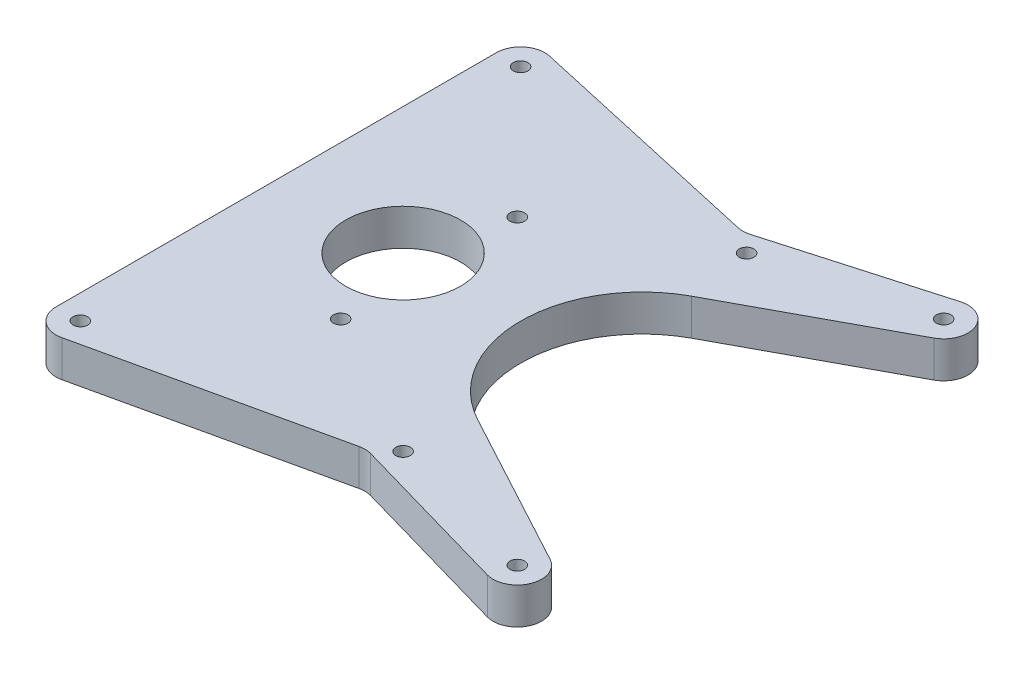
ISO-10303-21;
HEADER;
FILE_DESCRIPTION(('STEP AP214'),'2;1');
FILE_NAME('part.step','',(''),(''),'','','');
FILE_SCHEMA(('AUTOMOTIVE_DESIGN { 1 0 10303 214 1 1 1 1 }'));
ENDSEC;
DATA;
#1=APPLICATION_CONTEXT('core data for automotive mechanical design processes');
#2=APPLICATION_PROTOCOL_DEFINITION('international standard','automotive_design',2000,#1);
#3=PRODUCT_CONTEXT('',#1,'mechanical');
#4=PRODUCT('Part','Part','',(#3));
#5=PRODUCT_RELATED_PRODUCT_CATEGORY('part','',(#4));
#6=PRODUCT_DEFINITION_FORMATION('','',#4);
#7=PRODUCT_DEFINITION_CONTEXT('part definition',#1,'design');
#8=PRODUCT_DEFINITION('design','',#6,#7);
#9=PRODUCT_DEFINITION_SHAPE('','',#8);
#10=(LENGTH_UNIT() NAMED_UNIT(*) SI_UNIT(.MILLI.,.METRE.));
#11=(NAMED_UNIT(*) PLANE_ANGLE_UNIT() SI_UNIT($,.RADIAN.));
#12=(NAMED_UNIT(*) SI_UNIT($,.STERADIAN.) SOLID_ANGLE_UNIT());
#13=UNCERTAINTY_MEASURE_WITH_UNIT(LENGTH_MEASURE(1.E-05),#10,'distance_accuracy_value','');
#14=(GEOMETRIC_REPRESENTATION_CONTEXT(3) GLOBAL_UNCERTAINTY_ASSIGNED_CONTEXT((#13)) GLOBAL_UNIT_ASSIGNED_CONTEXT((#10,
#11,#12)) REPRESENTATION_CONTEXT('',''));
#15=CARTESIAN_POINT('',(0.,0.,0.));
#16=DIRECTION('',(0.,0.,1.));
#17=DIRECTION('',(1.,0.,0.));
#18=AXIS2_PLACEMENT_3D('',#15,#16,#17);
#19=CARTESIAN_POINT('',(39.4146219425762,4.7625,55.7330327987435));
#20=DIRECTION('',(0.,-1.,0.));
#21=DIRECTION('',(0.,0.,-1.));
#22=AXIS2_PLACEMENT_3D('',#19,#20,#21);
#23=CYLINDRICAL_SURFACE('',#22,6.35);
#24=CARTESIAN_POINT('',(39.4146219425762,-4.7625,55.7330327987435));
#25=DIRECTION('',(0.,1.,0.));
#26=DIRECTION('',(0.,0.,1.));
#27=AXIS2_PLACEMENT_3D('',#24,#25,#26);
#28=CIRCLE('',#27,6.35);
#29=CARTESIAN_POINT('',(41.1612903272004,-4.7625,49.6279816479213));
#30=VERTEX_POINT('',#29);
#31=CARTESIAN_POINT('',(38.0273586706714,-4.7625,49.5364207716415));
#32=VERTEX_POINT('',#31);
#33=EDGE_CURVE('E202',#30,#32,#28,.T.);
#34=ORIENTED_EDGE('',*,*,#33,.F.);
#35=DIRECTION('',(0.,-1.,0.));
#36=VECTOR('',#35,1.);
#37=CARTESIAN_POINT('',(41.1612903272004,4.7625,49.6279816479213));
#38=LINE('',#37,#36);
#39=CARTESIAN_POINT('',(41.1612903272004,4.7625,49.6279816479213));
#40=VERTEX_POINT('',#39);
#41=EDGE_CURVE('E12',#40,#30,#38,.T.);
#42=ORIENTED_EDGE('',*,*,#41,.F.);
#43=CARTESIAN_POINT('',(39.4146219425762,4.7625,55.7330327987435));
#44=DIRECTION('',(0.,1.,0.));
#45=DIRECTION('',(0.,0.,1.));
#46=AXIS2_PLACEMENT_3D('',#43,#44,#45);
#47=CIRCLE('',#46,6.35);
#48=CARTESIAN_POINT('',(38.0273586706714,4.7625,49.5364207716415));
#49=VERTEX_POINT('',#48);
#50=EDGE_CURVE('E264',#40,#49,#47,.T.);
#51=ORIENTED_EDGE('',*,*,#50,.T.);
#52=DIRECTION('',(0.,-1.,0.));
#53=VECTOR('',#52,1.);
#54=CARTESIAN_POINT('',(38.0273586706714,4.7625,49.5364207716415));
#55=LINE('',#54,#53);
#56=EDGE_CURVE('E114',#49,#32,#55,.T.);
#57=ORIENTED_EDGE('',*,*,#56,.T.);
#58=EDGE_LOOP('',(#34,#42,#51,#57));
#59=FACE_BOUND('',#58,.T.);
#60=ADVANCED_FACE('F45',(#59),#23,.F.);
#61=CARTESIAN_POINT('',(-10.01006963858,4.7625,34.9877444996349));
#62=DIRECTION('',(0.275065887342397,0.,-0.96142537808222));
#63=DIRECTION('',(-0.96142537808222,0.,-0.275065887342397));
#64=AXIS2_PLACEMENT_3D('',#61,#62,#63);
#65=PLANE('',#64);
#66=DIRECTION('',(0.96142537808222,0.,0.275065887342397));
#67=VECTOR('',#66,1.);
#68=CARTESIAN_POINT('',(-10.01006963858,-4.7625,34.9877444996349));
#69=LINE('',#68,#67);
#70=CARTESIAN_POINT('',(83.8387096727997,-4.7625,61.8380839495655));
#71=VERTEX_POINT('',#70);
#72=EDGE_CURVE('E205',#30,#71,#69,.T.);
#73=ORIENTED_EDGE('',*,*,#72,.T.);
#74=DIRECTION('',(0.,-1.,0.));
#75=VECTOR('',#74,1.);
#76=CARTESIAN_POINT('',(83.8387096727997,4.7625,61.8380839495655));
#77=LINE('',#76,#75);
#78=CARTESIAN_POINT('',(83.8387096727997,4.7625,61.8380839495655));
#79=VERTEX_POINT('',#78);
#80=EDGE_CURVE('E53',#79,#71,#77,.T.);
#81=ORIENTED_EDGE('',*,*,#80,.F.);
#82=DIRECTION('',(0.96142537808222,0.,0.275065887342397));
#83=VECTOR('',#82,1.);
#84=CARTESIAN_POINT('',(-10.01006963858,4.7625,34.9877444996349));
#85=LINE('',#84,#83);
#86=EDGE_CURVE('E309',#40,#79,#85,.T.);
#87=ORIENTED_EDGE('',*,*,#86,.F.);
#88=ORIENTED_EDGE('',*,*,#41,.T.);
#89=EDGE_LOOP('',(#73,#81,#87,#88));
#90=FACE_BOUND('',#89,.T.);
#91=ADVANCED_FACE('F295',(#90),#65,.F.);
#92=CARTESIAN_POINT('',(85.5853780574239,4.7625,55.7330327987434));
#93=DIRECTION('',(0.,-1.,0.));
#94=DIRECTION('',(0.,0.,-1.));
#95=AXIS2_PLACEMENT_3D('',#92,#93,#94);
#96=CYLINDRICAL_SURFACE('',#95,6.35000000000001);
#97=CARTESIAN_POINT('',(85.5853780574239,-4.7625,55.7330327987434));
#98=DIRECTION('',(0.,1.,0.));
#99=DIRECTION('',(0.,0.,1.));
#100=AXIS2_PLACEMENT_3D('',#97,#98,#99);
#101=CIRCLE('',#100,6.35000000000001);
#102=CARTESIAN_POINT('',(88.5990861082382,-4.7625,50.1437516477852));
#103=VERTEX_POINT('',#102);
#104=EDGE_CURVE('E208',#103,#71,#101,.F.);
#105=ORIENTED_EDGE('',*,*,#104,.F.);
#106=DIRECTION('',(0.,-1.,0.));
#107=VECTOR('',#106,1.);
#108=CARTESIAN_POINT('',(88.5990861082382,4.7625,50.1437516477852));
#109=LINE('',#108,#107);
#110=CARTESIAN_POINT('',(88.5990861082382,4.7625,50.1437516477852));
#111=VERTEX_POINT('',#110);
#112=EDGE_CURVE('E285',#111,#103,#109,.T.);
#113=ORIENTED_EDGE('',*,*,#112,.F.);
#114=CARTESIAN_POINT('',(85.5853780574239,4.7625,55.7330327987434));
#115=DIRECTION('',(0.,1.,0.));
#116=DIRECTION('',(0.,0.,1.));
#117=AXIS2_PLACEMENT_3D('',#114,#115,#116);
#118=CIRCLE('',#117,6.35000000000001);
#119=EDGE_CURVE('E292',#111,#79,#118,.F.);
#120=ORIENTED_EDGE('',*,*,#119,.T.);
#121=ORIENTED_EDGE('',*,*,#80,.T.);
#122=EDGE_LOOP('',(#105,#113,#120,#121));
#123=FACE_BOUND('',#122,.T.);
#124=ADVANCED_FACE('F290',(#123),#96,.T.);
#125=CARTESIAN_POINT('',(-0.990735964371023,4.7625,1.83743805234849));
#126=DIRECTION('',(0.474599693041635,0.,-0.880201756056409));
#127=DIRECTION('',(-0.880201756056409,0.,-0.474599693041635));
#128=AXIS2_PLACEMENT_3D('',#125,#126,#127);
#129=PLANE('',#128);
#130=DIRECTION('',(0.880201756056409,0.,0.474599693041635));
#131=VECTOR('',#130,1.);
#132=CARTESIAN_POINT('',(-0.990735964371023,-4.7625,1.83743805234849));
#133=LINE('',#132,#131);
#134=CARTESIAN_POINT('',(47.4314597459281,-4.7625,27.946405754791));
#135=VERTEX_POINT('',#134);
#136=EDGE_CURVE('E211',#135,#103,#133,.T.);
#137=ORIENTED_EDGE('',*,*,#136,.F.);
#138=DIRECTION('',(0.,-1.,0.));
#139=VECTOR('',#138,1.);
#140=CARTESIAN_POINT('',(47.4314597459281,4.7625,27.946405754791));
#141=LINE('',#140,#139);
#142=CARTESIAN_POINT('',(47.4314597459281,4.7625,27.946405754791));
#143=VERTEX_POINT('',#142);
#144=EDGE_CURVE('E283',#143,#135,#141,.T.);
#145=ORIENTED_EDGE('',*,*,#144,.F.);
#146=DIRECTION('',(0.880201756056409,0.,0.474599693041635));
#147=VECTOR('',#146,1.);
#148=CARTESIAN_POINT('',(-0.990735964371023,4.7625,1.83743805234849));
#149=LINE('',#148,#147);
#150=EDGE_CURVE('E306',#143,#111,#149,.T.);
#151=ORIENTED_EDGE('',*,*,#150,.T.);
#152=ORIENTED_EDGE('',*,*,#112,.T.);
#153=EDGE_LOOP('',(#137,#145,#151,#152));
#154=FACE_BOUND('',#153,.T.);
#155=ADVANCED_FACE('F303',(#154),#129,.T.);
#156=CARTESIAN_POINT('',(62.5,4.7625,0.));
#157=DIRECTION('',(0.,-1.,0.));
#158=DIRECTION('',(0.,0.,-1.));
#159=AXIS2_PLACEMENT_3D('',#156,#157,#158);
#160=CYLINDRICAL_SURFACE('',#159,31.75);
#161=CARTESIAN_POINT('',(62.5,-4.7625,0.));
#162=DIRECTION('',(0.,1.,0.));
#163=DIRECTION('',(0.,0.,1.));
#164=AXIS2_PLACEMENT_3D('',#161,#162,#163);
#165=CIRCLE('',#164,31.75);
#166=CARTESIAN_POINT('',(47.4314597459281,-4.7625,-27.946405754791));
#167=VERTEX_POINT('',#166);
#168=EDGE_CURVE('E213',#167,#135,#165,.T.);
#169=ORIENTED_EDGE('',*,*,#168,.F.);
#170=DIRECTION('',(0.,-1.,0.));
#171=VECTOR('',#170,1.);
#172=CARTESIAN_POINT('',(47.4314597459281,4.7625,-27.946405754791));
#173=LINE('',#172,#171);
#174=CARTESIAN_POINT('',(47.4314597459281,4.7625,-27.946405754791));
#175=VERTEX_POINT('',#174);
#176=EDGE_CURVE('E281',#175,#167,#173,.T.);
#177=ORIENTED_EDGE('',*,*,#176,.F.);
#178=CARTESIAN_POINT('',(62.5,4.7625,0.));
#179=DIRECTION('',(0.,1.,0.));
#180=DIRECTION('',(0.,0.,1.));
#181=AXIS2_PLACEMENT_3D('',#178,#179,#180);
#182=CIRCLE('',#181,31.75);
#183=EDGE_CURVE('E311',#175,#143,#182,.T.);
#184=ORIENTED_EDGE('',*,*,#183,.T.);
#185=ORIENTED_EDGE('',*,*,#144,.T.);
#186=EDGE_LOOP('',(#169,#177,#184,#185));
#187=FACE_BOUND('',#186,.T.);
#188=ADVANCED_FACE('F350',(#187),#160,.F.);
#189=CARTESIAN_POINT('',(-0.990735964371025,4.7625,-1.8374380523485));
#190=DIRECTION('',(-0.474599693041635,0.,-0.880201756056409));
#191=DIRECTION('',(-0.880201756056409,0.,0.474599693041635));
#192=AXIS2_PLACEMENT_3D('',#189,#190,#191);
#193=PLANE('',#192);
#194=DIRECTION('',(0.880201756056409,0.,-0.474599693041635));
#195=VECTOR('',#194,1.);
#196=CARTESIAN_POINT('',(-0.990735964371025,-4.7625,-1.8374380523485));
#197=LINE('',#196,#195);
#198=CARTESIAN_POINT('',(88.5990861082382,-4.7625,-50.1437516477853));
#199=VERTEX_POINT('',#198);
#200=EDGE_CURVE('E218',#167,#199,#197,.T.);
#201=ORIENTED_EDGE('',*,*,#200,.T.);
#202=DIRECTION('',(0.,-1.,0.));
#203=VECTOR('',#202,1.);
#204=CARTESIAN_POINT('',(88.5990861082382,4.7625,-50.1437516477853));
#205=LINE('',#204,#203);
#206=CARTESIAN_POINT('',(88.5990861082382,4.7625,-50.1437516477853));
#207=VERTEX_POINT('',#206);
#208=EDGE_CURVE('E278',#207,#199,#205,.T.);
#209=ORIENTED_EDGE('',*,*,#208,.F.);
#210=DIRECTION('',(0.880201756056409,0.,-0.474599693041635));
#211=VECTOR('',#210,1.);
#212=CARTESIAN_POINT('',(-0.990735964371025,4.7625,-1.8374380523485));
#213=LINE('',#212,#211);
#214=EDGE_CURVE('E317',#175,#207,#213,.T.);
#215=ORIENTED_EDGE('',*,*,#214,.F.);
#216=ORIENTED_EDGE('',*,*,#176,.T.);
#217=EDGE_LOOP('',(#201,#209,#215,#216));
#218=FACE_BOUND('',#217,.T.);
#219=ADVANCED_FACE('F353',(#218),#193,.F.);
#220=CARTESIAN_POINT('',(85.5853780574239,4.7625,-55.7330327987435));
#221=DIRECTION('',(0.,-1.,0.));
#222=DIRECTION('',(0.,0.,-1.));
#223=AXIS2_PLACEMENT_3D('',#220,#221,#222);
#224=CYLINDRICAL_SURFACE('',#223,6.35);
#225=CARTESIAN_POINT('',(85.5853780574239,-4.7625,-55.7330327987435));
#226=DIRECTION('',(0.,1.,0.));
#227=DIRECTION('',(0.,0.,1.));
#228=AXIS2_PLACEMENT_3D('',#225,#226,#227);
#229=CIRCLE('',#228,6.35);
#230=CARTESIAN_POINT('',(83.8387096727996,-4.7625,-61.8380839495656));
#231=VERTEX_POINT('',#230);
#232=EDGE_CURVE('E220',#199,#231,#229,.T.);
#233=ORIENTED_EDGE('',*,*,#232,.T.);
#234=DIRECTION('',(0.,-1.,0.));
#235=VECTOR('',#234,1.);
#236=CARTESIAN_POINT('',(83.8387096727996,4.7625,-61.8380839495656));
#237=LINE('',#236,#235);
#238=CARTESIAN_POINT('',(83.8387096727996,4.7625,-61.8380839495656));
#239=VERTEX_POINT('',#238);
#240=EDGE_CURVE('E275',#239,#231,#237,.T.);
#241=ORIENTED_EDGE('',*,*,#240,.F.);
#242=CARTESIAN_POINT('',(85.5853780574239,4.7625,-55.7330327987435));
#243=DIRECTION('',(0.,1.,0.));
#244=DIRECTION('',(0.,0.,1.));
#245=AXIS2_PLACEMENT_3D('',#242,#243,#244);
#246=CIRCLE('',#245,6.35);
#247=EDGE_CURVE('E319',#207,#239,#246,.T.);
#248=ORIENTED_EDGE('',*,*,#247,.F.);
#249=ORIENTED_EDGE('',*,*,#208,.T.);
#250=EDGE_LOOP('',(#233,#241,#248,#249));
#251=FACE_BOUND('',#250,.T.);
#252=ADVANCED_FACE('F357',(#251),#224,.T.);
#253=CARTESIAN_POINT('',(-10.01006963858,4.7625,-34.987744499635));
#254=DIRECTION('',(0.275065887342397,0.,0.96142537808222));
#255=DIRECTION('',(0.96142537808222,0.,-0.275065887342397));
#256=AXIS2_PLACEMENT_3D('',#253,#254,#255);
#257=PLANE('',#256);
#258=DIRECTION('',(-0.96142537808222,0.,0.275065887342397));
#259=VECTOR('',#258,1.);
#260=CARTESIAN_POINT('',(-10.01006963858,-4.7625,-34.987744499635));
#261=LINE('',#260,#259);
#262=CARTESIAN_POINT('',(41.1612903272004,-4.7625,-49.6279816479214));
#263=VERTEX_POINT('',#262);
#264=EDGE_CURVE('E222',#231,#263,#261,.T.);
#265=ORIENTED_EDGE('',*,*,#264,.T.);
#266=DIRECTION('',(0.,-1.,0.));
#267=VECTOR('',#266,1.);
#268=CARTESIAN_POINT('',(41.1612903272004,4.7625,-49.6279816479214));
#269=LINE('',#268,#267);
#270=CARTESIAN_POINT('',(41.1612903272004,4.7625,-49.6279816479214));
#271=VERTEX_POINT('',#270);
#272=EDGE_CURVE('E273',#271,#263,#269,.T.);
#273=ORIENTED_EDGE('',*,*,#272,.F.);
#274=DIRECTION('',(-0.96142537808222,0.,0.275065887342397));
#275=VECTOR('',#274,1.);
#276=CARTESIAN_POINT('',(-10.01006963858,4.7625,-34.987744499635));
#277=LINE('',#276,#275);
#278=EDGE_CURVE('E321',#239,#271,#277,.T.);
#279=ORIENTED_EDGE('',*,*,#278,.F.);
#280=ORIENTED_EDGE('',*,*,#240,.T.);
#281=EDGE_LOOP('',(#265,#273,#279,#280));
#282=FACE_BOUND('',#281,.T.);
#283=ADVANCED_FACE('F361',(#282),#257,.F.);
#284=CARTESIAN_POINT('',(39.4146219425761,4.7625,-55.7330327987435));
#285=DIRECTION('',(0.,-1.,0.));
#286=DIRECTION('',(0.,0.,-1.));
#287=AXIS2_PLACEMENT_3D('',#284,#285,#286);
#288=CYLINDRICAL_SURFACE('',#287,6.35);
#289=CARTESIAN_POINT('',(39.4146219425761,-4.7625,-55.7330327987435));
#290=DIRECTION('',(0.,1.,0.));
#291=DIRECTION('',(0.,0.,1.));
#292=AXIS2_PLACEMENT_3D('',#289,#290,#291);
#293=CIRCLE('',#292,6.35);
#294=CARTESIAN_POINT('',(38.0273586706714,-4.7625,-49.5364207716415));
#295=VERTEX_POINT('',#294);
#296=EDGE_CURVE('E225',#295,#263,#293,.T.);
#297=ORIENTED_EDGE('',*,*,#296,.F.);
#298=DIRECTION('',(0.,-1.,0.));
#299=VECTOR('',#298,1.);
#300=CARTESIAN_POINT('',(38.0273586706714,4.7625,-49.5364207716415));
#301=LINE('',#300,#299);
#302=CARTESIAN_POINT('',(38.0273586706714,4.7625,-49.5364207716415));
#303=VERTEX_POINT('',#302);
#304=EDGE_CURVE('E271',#303,#295,#301,.T.);
#305=ORIENTED_EDGE('',*,*,#304,.F.);
#306=CARTESIAN_POINT('',(39.4146219425761,4.7625,-55.7330327987435));
#307=DIRECTION('',(0.,1.,0.));
#308=DIRECTION('',(0.,0.,1.));
#309=AXIS2_PLACEMENT_3D('',#306,#307,#308);
#310=CIRCLE('',#309,6.35);
#311=EDGE_CURVE('E323',#303,#271,#310,.T.);
#312=ORIENTED_EDGE('',*,*,#311,.T.);
#313=ORIENTED_EDGE('',*,*,#272,.T.);
#314=EDGE_LOOP('',(#297,#305,#312,#313));
#315=FACE_BOUND('',#314,.T.);
#316=ADVANCED_FACE('F365',(#315),#288,.F.);
#317=CARTESIAN_POINT('',(12.3756007461316,4.7625,-55.2791946411148));
#318=DIRECTION('',(-0.218466656992869,0.,0.975844413716838));
#319=DIRECTION('',(0.975844413716838,0.,0.218466656992869));
#320=AXIS2_PLACEMENT_3D('',#317,#318,#319);
#321=PLANE('',#320);
#322=DIRECTION('',(-0.975844413716838,0.,-0.218466656992869));
#323=VECTOR('',#322,1.);
#324=CARTESIAN_POINT('',(12.3756007461316,-4.7625,-55.2791946411148));
#325=LINE('',#324,#323);
#326=CARTESIAN_POINT('',(-25.4489963486296,-4.7625,-63.7471565039293));
#327=VERTEX_POINT('',#326);
#328=EDGE_CURVE('E228',#295,#327,#325,.T.);
#329=ORIENTED_EDGE('',*,*,#328,.T.);
#330=DIRECTION('',(0.,-1.,0.));
#331=VECTOR('',#330,1.);
#332=CARTESIAN_POINT('',(-25.4489963486296,4.7625,-63.7471565039293));
#333=LINE('',#332,#331);
#334=CARTESIAN_POINT('',(-25.4489963486296,4.7625,-63.7471565039293));
#335=VERTEX_POINT('',#334);
#336=EDGE_CURVE('E268',#335,#327,#333,.T.);
#337=ORIENTED_EDGE('',*,*,#336,.F.);
#338=DIRECTION('',(-0.975844413716838,0.,-0.218466656992869));
#339=VECTOR('',#338,1.);
#340=CARTESIAN_POINT('',(12.3756007461316,4.7625,-55.2791946411148));
#341=LINE('',#340,#339);
#342=EDGE_CURVE('E326',#303,#335,#341,.T.);
#343=ORIENTED_EDGE('',*,*,#342,.F.);
#344=ORIENTED_EDGE('',*,*,#304,.T.);
#345=EDGE_LOOP('',(#329,#337,#343,#344));
#346=FACE_BOUND('',#345,.T.);
#347=ADVANCED_FACE('F331',(#346),#321,.F.);
#348=CARTESIAN_POINT('',(-26.8362596205343,4.7625,-57.5505444768273));
#349=DIRECTION('',(0.,-1.,0.));
#350=DIRECTION('',(0.,0.,-1.));
#351=AXIS2_PLACEMENT_3D('',#348,#349,#350);
#352=CYLINDRICAL_SURFACE('',#351,6.34999999999999);
#353=CARTESIAN_POINT('',(-26.8362596205343,-4.7625,-57.5505444768273));
#354=DIRECTION('',(0.,1.,0.));
#355=DIRECTION('',(0.,0.,1.));
#356=AXIS2_PLACEMENT_3D('',#353,#354,#355);
#357=CIRCLE('',#356,6.34999999999999);
#358=CARTESIAN_POINT('',(-33.1862596205343,-4.7625,-57.5505444768273));
#359=VERTEX_POINT('',#358);
#360=EDGE_CURVE('E230',#327,#359,#357,.T.);
#361=ORIENTED_EDGE('',*,*,#360,.T.);
#362=DIRECTION('',(0.,-1.,0.));
#363=VECTOR('',#362,1.);
#364=CARTESIAN_POINT('',(-33.1862596205343,4.7625,-57.5505444768273));
#365=LINE('',#364,#363);
#366=CARTESIAN_POINT('',(-33.1862596205343,4.7625,-57.5505444768273));
#367=VERTEX_POINT('',#366);
#368=EDGE_CURVE('E167',#367,#359,#365,.T.);
#369=ORIENTED_EDGE('',*,*,#368,.F.);
#370=CARTESIAN_POINT('',(-26.8362596205343,4.7625,-57.5505444768273));
#371=DIRECTION('',(0.,1.,0.));
#372=DIRECTION('',(0.,0.,1.));
#373=AXIS2_PLACEMENT_3D('',#370,#371,#372);
#374=CIRCLE('',#373,6.34999999999999);
#375=EDGE_CURVE('E158',#335,#367,#374,.T.);
#376=ORIENTED_EDGE('',*,*,#375,.F.);
#377=ORIENTED_EDGE('',*,*,#336,.T.);
#378=EDGE_LOOP('',(#361,#369,#376,#377));
#379=FACE_BOUND('',#378,.T.);
#380=ADVANCED_FACE('F335',(#379),#352,.T.);
#381=CARTESIAN_POINT('',(-33.1862596205343,4.7625,0.));
#382=DIRECTION('',(1.,0.,0.));
#383=DIRECTION('',(0.,0.,-1.));
#384=AXIS2_PLACEMENT_3D('',#381,#382,#383);
#385=PLANE('',#384);
#386=DIRECTION('',(0.,0.,1.));
#387=VECTOR('',#386,1.);
#388=CARTESIAN_POINT('',(-33.1862596205343,-4.7625,0.));
#389=LINE('',#388,#387);
#390=CARTESIAN_POINT('',(-33.1862596205343,-4.7625,57.5505444768273));
#391=VERTEX_POINT('',#390);
#392=EDGE_CURVE('E166',#359,#391,#389,.T.);
#393=ORIENTED_EDGE('',*,*,#392,.T.);
#394=DIRECTION('',(0.,-1.,0.));
#395=VECTOR('',#394,1.);
#396=CARTESIAN_POINT('',(-33.1862596205343,4.7625,57.5505444768273));
#397=LINE('',#396,#395);
#398=CARTESIAN_POINT('',(-33.1862596205343,4.7625,57.5505444768273));
#399=VERTEX_POINT('',#398);
#400=EDGE_CURVE('E163',#399,#391,#397,.T.);
#401=ORIENTED_EDGE('',*,*,#400,.F.);
#402=DIRECTION('',(0.,0.,1.));
#403=VECTOR('',#402,1.);
#404=CARTESIAN_POINT('',(-33.1862596205343,4.7625,0.));
#405=LINE('',#404,#403);
#406=EDGE_CURVE('E151',#367,#399,#405,.T.);
#407=ORIENTED_EDGE('',*,*,#406,.F.);
#408=ORIENTED_EDGE('',*,*,#368,.T.);
#409=EDGE_LOOP('',(#393,#401,#407,#408));
#410=FACE_BOUND('',#409,.T.);
#411=ADVANCED_FACE('F164',(#410),#385,.F.);
#412=CARTESIAN_POINT('',(-26.8362596205343,4.7625,57.5505444768273));
#413=DIRECTION('',(0.,-1.,0.));
#414=DIRECTION('',(0.,0.,-1.));
#415=AXIS2_PLACEMENT_3D('',#412,#413,#414);
#416=CYLINDRICAL_SURFACE('',#415,6.35);
#417=CARTESIAN_POINT('',(-26.8362596205343,-4.7625,57.5505444768273));
#418=DIRECTION('',(0.,1.,0.));
#419=DIRECTION('',(0.,0.,1.));
#420=AXIS2_PLACEMENT_3D('',#417,#418,#419);
#421=CIRCLE('',#420,6.35);
#422=CARTESIAN_POINT('',(-25.4489963486296,-4.7625,63.7471565039293));
#423=VERTEX_POINT('',#422);
#424=EDGE_CURVE('E107',#391,#423,#421,.T.);
#425=ORIENTED_EDGE('',*,*,#424,.T.);
#426=DIRECTION('',(0.,-1.,0.));
#427=VECTOR('',#426,1.);
#428=CARTESIAN_POINT('',(-25.4489963486296,4.7625,63.7471565039293));
#429=LINE('',#428,#427);
#430=CARTESIAN_POINT('',(-25.4489963486296,4.7625,63.7471565039293));
#431=VERTEX_POINT('',#430);
#432=EDGE_CURVE('E168',#431,#423,#429,.T.);
#433=ORIENTED_EDGE('',*,*,#432,.F.);
#434=CARTESIAN_POINT('',(-26.8362596205343,4.7625,57.5505444768273));
#435=DIRECTION('',(0.,1.,0.));
#436=DIRECTION('',(0.,0.,1.));
#437=AXIS2_PLACEMENT_3D('',#434,#435,#436);
#438=CIRCLE('',#437,6.35);
#439=EDGE_CURVE('E156',#399,#431,#438,.T.);
#440=ORIENTED_EDGE('',*,*,#439,.F.);
#441=ORIENTED_EDGE('',*,*,#400,.T.);
#442=EDGE_LOOP('',(#425,#433,#440,#441));
#443=FACE_BOUND('',#442,.T.);
#444=ADVANCED_FACE('F170',(#443),#416,.T.);
#445=CARTESIAN_POINT('',(85.5853780574239,4.7625,-55.7330327987435));
#446=DIRECTION('',(0.,-1.,0.));
#447=DIRECTION('',(0.,0.,-1.));
#448=AXIS2_PLACEMENT_3D('',#445,#446,#447);
#449=CYLINDRICAL_SURFACE('',#448,1.90500000000001);
#450=CARTESIAN_POINT('',(85.5853780574239,4.7625,-55.7330327987435));
#451=DIRECTION('',(0.,1.,0.));
#452=DIRECTION('',(0.,0.,1.));
#453=AXIS2_PLACEMENT_3D('',#450,#451,#452);
#454=CIRCLE('',#453,1.90500000000001);
#455=CARTESIAN_POINT('',(85.5853780574239,4.7625,-53.8280327987434));
#456=VERTEX_POINT('',#455);
#457=EDGE_CURVE('E196',#456,#456,#454,.T.);
#458=ORIENTED_EDGE('',*,*,#457,.T.);
#459=EDGE_LOOP('',(#458));
#460=FACE_BOUND('',#459,.T.);
#461=CARTESIAN_POINT('',(85.5853780574239,-4.7625,-55.7330327987435));
#462=DIRECTION('',(0.,1.,0.));
#463=DIRECTION('',(0.,0.,1.));
#464=AXIS2_PLACEMENT_3D('',#461,#462,#463);
#465=CIRCLE('',#464,1.90500000000001);
#466=CARTESIAN_POINT('',(85.5853780574239,-4.7625,-53.8280327987434));
#467=VERTEX_POINT('',#466);
#468=EDGE_CURVE('E258',#467,#467,#465,.T.);
#469=ORIENTED_EDGE('',*,*,#468,.F.);
#470=EDGE_LOOP('',(#469));
#471=FACE_BOUND('',#470,.T.);
#472=ADVANCED_FACE('F378',(#460,#471),#449,.F.);
#473=CARTESIAN_POINT('',(-26.8362596205343,4.7625,-57.5505444768273));
#474=DIRECTION('',(0.,-1.,0.));
#475=DIRECTION('',(0.,0.,-1.));
#476=AXIS2_PLACEMENT_3D('',#473,#474,#475);
#477=CYLINDRICAL_SURFACE('',#476,1.905);
#478=CARTESIAN_POINT('',(-26.8362596205343,4.7625,-57.5505444768273));
#479=DIRECTION('',(0.,1.,0.));
#480=DIRECTION('',(0.,0.,1.));
#481=AXIS2_PLACEMENT_3D('',#478,#479,#480);
#482=CIRCLE('',#481,1.905);
#483=CARTESIAN_POINT('',(-26.8362596205343,4.7625,-55.6455444768273));
#484=VERTEX_POINT('',#483);
#485=EDGE_CURVE('E193',#484,#484,#482,.T.);
#486=ORIENTED_EDGE('',*,*,#485,.T.);
#487=EDGE_LOOP('',(#486));
#488=FACE_BOUND('',#487,.T.);
#489=CARTESIAN_POINT('',(-26.8362596205343,-4.7625,-57.5505444768273));
#490=DIRECTION('',(0.,1.,0.));
#491=DIRECTION('',(0.,0.,1.));
#492=AXIS2_PLACEMENT_3D('',#489,#490,#491);
#493=CIRCLE('',#492,1.905);
#494=CARTESIAN_POINT('',(-26.8362596205343,-4.7625,-55.6455444768273));
#495=VERTEX_POINT('',#494);
#496=EDGE_CURVE('E255',#495,#495,#493,.T.);
#497=ORIENTED_EDGE('',*,*,#496,.F.);
#498=EDGE_LOOP('',(#497));
#499=FACE_BOUND('',#498,.T.);
#500=ADVANCED_FACE('F405',(#488,#499),#477,.F.);
#501=CARTESIAN_POINT('',(-26.8362596205343,4.7625,57.5505444768273));
#502=DIRECTION('',(0.,-1.,0.));
#503=DIRECTION('',(0.,0.,-1.));
#504=AXIS2_PLACEMENT_3D('',#501,#502,#503);
#505=CYLINDRICAL_SURFACE('',#504,1.905);
#506=CARTESIAN_POINT('',(-26.8362596205343,4.7625,57.5505444768273));
#507=DIRECTION('',(0.,1.,0.));
#508=DIRECTION('',(0.,0.,1.));
#509=AXIS2_PLACEMENT_3D('',#506,#507,#508);
#510=CIRCLE('',#509,1.905);
#511=CARTESIAN_POINT('',(-26.8362596205343,4.7625,59.4555444768273));
#512=VERTEX_POINT('',#511);
#513=EDGE_CURVE('E190',#512,#512,#510,.T.);
#514=ORIENTED_EDGE('',*,*,#513,.T.);
#515=EDGE_LOOP('',(#514));
#516=FACE_BOUND('',#515,.T.);
#517=CARTESIAN_POINT('',(-26.8362596205343,-4.7625,57.5505444768273));
#518=DIRECTION('',(0.,1.,0.));
#519=DIRECTION('',(0.,0.,1.));
#520=AXIS2_PLACEMENT_3D('',#517,#518,#519);
#521=CIRCLE('',#520,1.905);
#522=CARTESIAN_POINT('',(-26.8362596205343,-4.7625,59.4555444768273));
#523=VERTEX_POINT('',#522);
#524=EDGE_CURVE('E252',#523,#523,#521,.T.);
#525=ORIENTED_EDGE('',*,*,#524,.F.);
#526=EDGE_LOOP('',(#525));
#527=FACE_BOUND('',#526,.T.);
#528=ADVANCED_FACE('F401',(#516,#527),#505,.F.);
#529=CARTESIAN_POINT('',(44.901280605346,4.7625,44.9012806053455));
#530=DIRECTION('',(0.,-1.,0.));
#531=DIRECTION('',(0.,0.,-1.));
#532=AXIS2_PLACEMENT_3D('',#529,#530,#531);
#533=CYLINDRICAL_SURFACE('',#532,1.905);
#534=CARTESIAN_POINT('',(44.901280605346,4.7625,44.9012806053455));
#535=DIRECTION('',(0.,1.,0.));
#536=DIRECTION('',(0.,0.,1.));
#537=AXIS2_PLACEMENT_3D('',#534,#535,#536);
#538=CIRCLE('',#537,1.905);
#539=CARTESIAN_POINT('',(44.901280605346,4.7625,46.8062806053455));
#540=VERTEX_POINT('',#539);
#541=EDGE_CURVE('E187',#540,#540,#538,.T.);
#542=ORIENTED_EDGE('',*,*,#541,.T.);
#543=EDGE_LOOP('',(#542));
#544=FACE_BOUND('',#543,.T.);
#545=CARTESIAN_POINT('',(44.901280605346,-4.7625,44.9012806053455));
#546=DIRECTION('',(0.,1.,0.));
#547=DIRECTION('',(0.,0.,1.));
#548=AXIS2_PLACEMENT_3D('',#545,#546,#547);
#549=CIRCLE('',#548,1.905);
#550=CARTESIAN_POINT('',(44.901280605346,-4.7625,46.8062806053455));
#551=VERTEX_POINT('',#550);
#552=EDGE_CURVE('E249',#551,#551,#549,.T.);
#553=ORIENTED_EDGE('',*,*,#552,.F.);
#554=EDGE_LOOP('',(#553));
#555=FACE_BOUND('',#554,.T.);
#556=ADVANCED_FACE('F397',(#544,#555),#533,.F.);
#557=CARTESIAN_POINT('',(44.901280605346,4.7625,-44.9012806053455));
#558=DIRECTION('',(0.,-1.,0.));
#559=DIRECTION('',(0.,0.,-1.));
#560=AXIS2_PLACEMENT_3D('',#557,#558,#559);
#561=CYLINDRICAL_SURFACE('',#560,1.90500000000001);
#562=CARTESIAN_POINT('',(44.901280605346,4.7625,-44.9012806053455));
#563=DIRECTION('',(0.,1.,0.));
#564=DIRECTION('',(0.,0.,1.));
#565=AXIS2_PLACEMENT_3D('',#562,#563,#564);
#566=CIRCLE('',#565,1.90500000000001);
#567=CARTESIAN_POINT('',(44.901280605346,4.7625,-42.9962806053455));
#568=VERTEX_POINT('',#567);
#569=EDGE_CURVE('E184',#568,#568,#566,.T.);
#570=ORIENTED_EDGE('',*,*,#569,.T.);
#571=EDGE_LOOP('',(#570));
#572=FACE_BOUND('',#571,.T.);
#573=CARTESIAN_POINT('',(44.901280605346,-4.7625,-44.9012806053455));
#574=DIRECTION('',(0.,1.,0.));
#575=DIRECTION('',(0.,0.,1.));
#576=AXIS2_PLACEMENT_3D('',#573,#574,#575);
#577=CIRCLE('',#576,1.90500000000001);
#578=CARTESIAN_POINT('',(44.901280605346,-4.7625,-42.9962806053455));
#579=VERTEX_POINT('',#578);
#580=EDGE_CURVE('E246',#579,#579,#577,.T.);
#581=ORIENTED_EDGE('',*,*,#580,.F.);
#582=EDGE_LOOP('',(#581));
#583=FACE_BOUND('',#582,.T.);
#584=ADVANCED_FACE('F393',(#572,#583),#561,.F.);
#585=CARTESIAN_POINT('',(0.,4.7625,0.));
#586=DIRECTION('',(0.,-1.,0.));
#587=DIRECTION('',(0.,0.,-1.));
#588=AXIS2_PLACEMENT_3D('',#585,#586,#587);
#589=CYLINDRICAL_SURFACE('',#588,15.012499947);
#590=CARTESIAN_POINT('',(0.,4.7625,0.));
#591=DIRECTION('',(0.,1.,0.));
#592=DIRECTION('',(0.,0.,1.));
#593=AXIS2_PLACEMENT_3D('',#590,#591,#592);
#594=CIRCLE('',#593,15.012499947);
#595=CARTESIAN_POINT('',(0.,4.7625,15.012499947));
#596=VERTEX_POINT('',#595);
#597=EDGE_CURVE('E181',#596,#596,#594,.T.);
#598=ORIENTED_EDGE('',*,*,#597,.T.);
#599=EDGE_LOOP('',(#598));
#600=FACE_BOUND('',#599,.T.);
#601=CARTESIAN_POINT('',(0.,-4.7625,0.));
#602=DIRECTION('',(0.,1.,0.));
#603=DIRECTION('',(0.,0.,1.));
#604=AXIS2_PLACEMENT_3D('',#601,#602,#603);
#605=CIRCLE('',#604,15.012499947);
#606=CARTESIAN_POINT('',(0.,-4.7625,15.012499947));
#607=VERTEX_POINT('',#606);
#608=EDGE_CURVE('E242',#607,#607,#605,.T.);
#609=ORIENTED_EDGE('',*,*,#608,.F.);
#610=EDGE_LOOP('',(#609));
#611=FACE_BOUND('',#610,.T.);
#612=ADVANCED_FACE('F389',(#600,#611),#589,.F.);
#613=CARTESIAN_POINT('',(6.76696720125666,4.7625,23.0853780574241));
#614=DIRECTION('',(0.,-1.,0.));
#615=DIRECTION('',(0.,0.,-1.));
#616=AXIS2_PLACEMENT_3D('',#613,#614,#615);
#617=CYLINDRICAL_SURFACE('',#616,1.905);
#618=CARTESIAN_POINT('',(6.76696720125666,4.7625,23.0853780574241));
#619=DIRECTION('',(0.,1.,0.));
#620=DIRECTION('',(0.,0.,1.));
#621=AXIS2_PLACEMENT_3D('',#618,#619,#620);
#622=CIRCLE('',#621,1.905);
#623=CARTESIAN_POINT('',(6.76696720125666,4.7625,24.9903780574241));
#624=VERTEX_POINT('',#623);
#625=EDGE_CURVE('E178',#624,#624,#622,.F.);
#626=ORIENTED_EDGE('',*,*,#625,.F.);
#627=EDGE_LOOP('',(#626));
#628=FACE_BOUND('',#627,.T.);
#629=CARTESIAN_POINT('',(6.76696720125666,-4.7625,23.0853780574241));
#630=DIRECTION('',(0.,1.,0.));
#631=DIRECTION('',(0.,0.,1.));
#632=AXIS2_PLACEMENT_3D('',#629,#630,#631);
#633=CIRCLE('',#632,1.905);
#634=CARTESIAN_POINT('',(6.76696720125666,-4.7625,24.9903780574241));
#635=VERTEX_POINT('',#634);
#636=EDGE_CURVE('E239',#635,#635,#633,.F.);
#637=ORIENTED_EDGE('',*,*,#636,.T.);
#638=EDGE_LOOP('',(#637));
#639=FACE_BOUND('',#638,.T.);
#640=ADVANCED_FACE('F385',(#628,#639),#617,.F.);
#641=CARTESIAN_POINT('',(6.76696720125665,4.7625,-23.0853780574241));
#642=DIRECTION('',(0.,-1.,0.));
#643=DIRECTION('',(0.,0.,-1.));
#644=AXIS2_PLACEMENT_3D('',#641,#642,#643);
#645=CYLINDRICAL_SURFACE('',#644,1.905);
#646=CARTESIAN_POINT('',(6.76696720125665,4.7625,-23.0853780574241));
#647=DIRECTION('',(0.,1.,0.));
#648=DIRECTION('',(0.,0.,1.));
#649=AXIS2_PLACEMENT_3D('',#646,#647,#648);
#650=CIRCLE('',#649,1.905);
#651=CARTESIAN_POINT('',(6.76696720125665,4.7625,-21.1803780574241));
#652=VERTEX_POINT('',#651);
#653=EDGE_CURVE('E172',#652,#652,#650,.T.);
#654=ORIENTED_EDGE('',*,*,#653,.T.);
#655=EDGE_LOOP('',(#654));
#656=FACE_BOUND('',#655,.T.);
#657=CARTESIAN_POINT('',(6.76696720125665,-4.7625,-23.0853780574241));
#658=DIRECTION('',(0.,1.,0.));
#659=DIRECTION('',(0.,0.,1.));
#660=AXIS2_PLACEMENT_3D('',#657,#658,#659);
#661=CIRCLE('',#660,1.905);
#662=CARTESIAN_POINT('',(6.76696720125665,-4.7625,-21.1803780574241));
#663=VERTEX_POINT('',#662);
#664=EDGE_CURVE('E236',#663,#663,#661,.T.);
#665=ORIENTED_EDGE('',*,*,#664,.F.);
#666=EDGE_LOOP('',(#665));
#667=FACE_BOUND('',#666,.T.);
#668=ADVANCED_FACE('F382',(#656,#667),#645,.F.);
#669=CARTESIAN_POINT('',(12.3756007461316,4.7625,55.2791946411148));
#670=DIRECTION('',(-0.218466656992869,0.,-0.975844413716838));
#671=DIRECTION('',(-0.975844413716838,0.,0.218466656992869));
#672=AXIS2_PLACEMENT_3D('',#669,#670,#671);
#673=PLANE('',#672);
#674=DIRECTION('',(0.975844413716838,0.,-0.218466656992869));
#675=VECTOR('',#674,1.);
#676=CARTESIAN_POINT('',(12.3756007461316,-4.7625,55.2791946411148));
#677=LINE('',#676,#675);
#678=EDGE_CURVE('E234',#423,#32,#677,.T.);
#679=ORIENTED_EDGE('',*,*,#678,.T.);
#680=ORIENTED_EDGE('',*,*,#56,.F.);
#681=DIRECTION('',(0.975844413716838,0.,-0.218466656992869));
#682=VECTOR('',#681,1.);
#683=CARTESIAN_POINT('',(12.3756007461316,4.7625,55.2791946411148));
#684=LINE('',#683,#682);
#685=EDGE_CURVE('E61',#431,#49,#684,.T.);
#686=ORIENTED_EDGE('',*,*,#685,.F.);
#687=ORIENTED_EDGE('',*,*,#432,.T.);
#688=EDGE_LOOP('',(#679,#680,#686,#687));
#689=FACE_BOUND('',#688,.T.);
#690=ADVANCED_FACE('F338',(#689),#673,.F.);
#691=CARTESIAN_POINT('',(85.5853780574239,4.7625,55.7330327987434));
#692=DIRECTION('',(0.,-1.,0.));
#693=DIRECTION('',(0.,0.,-1.));
#694=AXIS2_PLACEMENT_3D('',#691,#692,#693);
#695=CYLINDRICAL_SURFACE('',#694,1.90500000000001);
#696=CARTESIAN_POINT('',(85.5853780574239,4.7625,55.7330327987434));
#697=DIRECTION('',(0.,1.,0.));
#698=DIRECTION('',(0.,0.,1.));
#699=AXIS2_PLACEMENT_3D('',#696,#697,#698);
#700=CIRCLE('',#699,1.90500000000001);
#701=CARTESIAN_POINT('',(85.5853780574239,4.7625,57.6380327987434));
#702=VERTEX_POINT('',#701);
#703=EDGE_CURVE('E199',#702,#702,#700,.F.);
#704=ORIENTED_EDGE('',*,*,#703,.F.);
#705=EDGE_LOOP('',(#704));
#706=FACE_BOUND('',#705,.T.);
#707=CARTESIAN_POINT('',(85.5853780574239,-4.7625,55.7330327987434));
#708=DIRECTION('',(0.,1.,0.));
#709=DIRECTION('',(0.,0.,1.));
#710=AXIS2_PLACEMENT_3D('',#707,#708,#709);
#711=CIRCLE('',#710,1.90500000000001);
#712=CARTESIAN_POINT('',(85.5853780574239,-4.7625,57.6380327987434));
#713=VERTEX_POINT('',#712);
#714=EDGE_CURVE('E261',#713,#713,#711,.F.);
#715=ORIENTED_EDGE('',*,*,#714,.T.);
#716=EDGE_LOOP('',(#715));
#717=FACE_BOUND('',#716,.T.);
#718=ADVANCED_FACE('F381',(#706,#717),#695,.F.);
#719=CARTESIAN_POINT('',(0.,4.7625,0.));
#720=DIRECTION('',(0.,1.,0.));
#721=DIRECTION('',(0.,0.,1.));
#722=AXIS2_PLACEMENT_3D('',#719,#720,#721);
#723=PLANE('',#722);
#724=ORIENTED_EDGE('',*,*,#50,.F.);
#725=ORIENTED_EDGE('',*,*,#86,.T.);
#726=ORIENTED_EDGE('',*,*,#119,.F.);
#727=ORIENTED_EDGE('',*,*,#150,.F.);
#728=ORIENTED_EDGE('',*,*,#183,.F.);
#729=ORIENTED_EDGE('',*,*,#214,.T.);
#730=ORIENTED_EDGE('',*,*,#247,.T.);
#731=ORIENTED_EDGE('',*,*,#278,.T.);
#732=ORIENTED_EDGE('',*,*,#311,.F.);
#733=ORIENTED_EDGE('',*,*,#342,.T.);
#734=ORIENTED_EDGE('',*,*,#375,.T.);
#735=ORIENTED_EDGE('',*,*,#406,.T.);
#736=ORIENTED_EDGE('',*,*,#439,.T.);
#737=ORIENTED_EDGE('',*,*,#685,.T.);
#738=EDGE_LOOP('',(#724,#725,#726,#727,#728,#729,#730,#731,#732,#733,#734,#735,#736,#737));
#739=FACE_BOUND('',#738,.T.);
#740=ORIENTED_EDGE('',*,*,#653,.F.);
#741=EDGE_LOOP('',(#740));
#742=FACE_BOUND('',#741,.T.);
#743=ORIENTED_EDGE('',*,*,#625,.T.);
#744=EDGE_LOOP('',(#743));
#745=FACE_BOUND('',#744,.T.);
#746=ORIENTED_EDGE('',*,*,#597,.F.);
#747=EDGE_LOOP('',(#746));
#748=FACE_BOUND('',#747,.T.);
#749=ORIENTED_EDGE('',*,*,#569,.F.);
#750=EDGE_LOOP('',(#749));
#751=FACE_BOUND('',#750,.T.);
#752=ORIENTED_EDGE('',*,*,#541,.F.);
#753=EDGE_LOOP('',(#752));
#754=FACE_BOUND('',#753,.T.);
#755=ORIENTED_EDGE('',*,*,#513,.F.);
#756=EDGE_LOOP('',(#755));
#757=FACE_BOUND('',#756,.T.);
#758=ORIENTED_EDGE('',*,*,#485,.F.);
#759=EDGE_LOOP('',(#758));
#760=FACE_BOUND('',#759,.T.);
#761=ORIENTED_EDGE('',*,*,#457,.F.);
#762=EDGE_LOOP('',(#761));
#763=FACE_BOUND('',#762,.T.);
#764=ORIENTED_EDGE('',*,*,#703,.T.);
#765=EDGE_LOOP('',(#764));
#766=FACE_BOUND('',#765,.T.);
#767=ADVANCED_FACE('F153',(#739,#742,#745,#748,#751,#754,#757,#760,#763,#766),#723,.T.);
#768=CARTESIAN_POINT('',(0.,-4.7625,0.));
#769=DIRECTION('',(0.,1.,0.));
#770=DIRECTION('',(0.,0.,1.));
#771=AXIS2_PLACEMENT_3D('',#768,#769,#770);
#772=PLANE('',#771);
#773=ORIENTED_EDGE('',*,*,#33,.T.);
#774=ORIENTED_EDGE('',*,*,#678,.F.);
#775=ORIENTED_EDGE('',*,*,#424,.F.);
#776=ORIENTED_EDGE('',*,*,#392,.F.);
#777=ORIENTED_EDGE('',*,*,#360,.F.);
#778=ORIENTED_EDGE('',*,*,#328,.F.);
#779=ORIENTED_EDGE('',*,*,#296,.T.);
#780=ORIENTED_EDGE('',*,*,#264,.F.);
#781=ORIENTED_EDGE('',*,*,#232,.F.);
#782=ORIENTED_EDGE('',*,*,#200,.F.);
#783=ORIENTED_EDGE('',*,*,#168,.T.);
#784=ORIENTED_EDGE('',*,*,#136,.T.);
#785=ORIENTED_EDGE('',*,*,#104,.T.);
#786=ORIENTED_EDGE('',*,*,#72,.F.);
#787=EDGE_LOOP('',(#773,#774,#775,#776,#777,#778,#779,#780,#781,#782,#783,#784,#785,#786));
#788=FACE_BOUND('',#787,.T.);
#789=ORIENTED_EDGE('',*,*,#664,.T.);
#790=EDGE_LOOP('',(#789));
#791=FACE_BOUND('',#790,.T.);
#792=ORIENTED_EDGE('',*,*,#636,.F.);
#793=EDGE_LOOP('',(#792));
#794=FACE_BOUND('',#793,.T.);
#795=ORIENTED_EDGE('',*,*,#608,.T.);
#796=EDGE_LOOP('',(#795));
#797=FACE_BOUND('',#796,.T.);
#798=ORIENTED_EDGE('',*,*,#580,.T.);
#799=EDGE_LOOP('',(#798));
#800=FACE_BOUND('',#799,.T.);
#801=ORIENTED_EDGE('',*,*,#552,.T.);
#802=EDGE_LOOP('',(#801));
#803=FACE_BOUND('',#802,.T.);
#804=ORIENTED_EDGE('',*,*,#524,.T.);
#805=EDGE_LOOP('',(#804));
#806=FACE_BOUND('',#805,.T.);
#807=ORIENTED_EDGE('',*,*,#496,.T.);
#808=EDGE_LOOP('',(#807));
#809=FACE_BOUND('',#808,.T.);
#810=ORIENTED_EDGE('',*,*,#468,.T.);
#811=EDGE_LOOP('',(#810));
#812=FACE_BOUND('',#811,.T.);
#813=ORIENTED_EDGE('',*,*,#714,.F.);
#814=EDGE_LOOP('',(#813));
#815=FACE_BOUND('',#814,.T.);
#816=ADVANCED_FACE('F297',(#788,#791,#794,#797,#800,#803,#806,#809,#812,#815),#772,.F.);
#817=CLOSED_SHELL('',(#60,#91,#124,#155,#188,#219,#252,#283,#316,#347,#380,#411,#444,#472,#500,
#528,#556,#584,#612,#640,#668,#690,#718,#767,#816));
#818=MANIFOLD_SOLID_BREP('B2',#817);
#819=ADVANCED_BREP_SHAPE_REPRESENTATION('',(#18,#818),#14);
#820=SHAPE_DEFINITION_REPRESENTATION(#9,#819);
ENDSEC;
END-ISO-10303-21;
